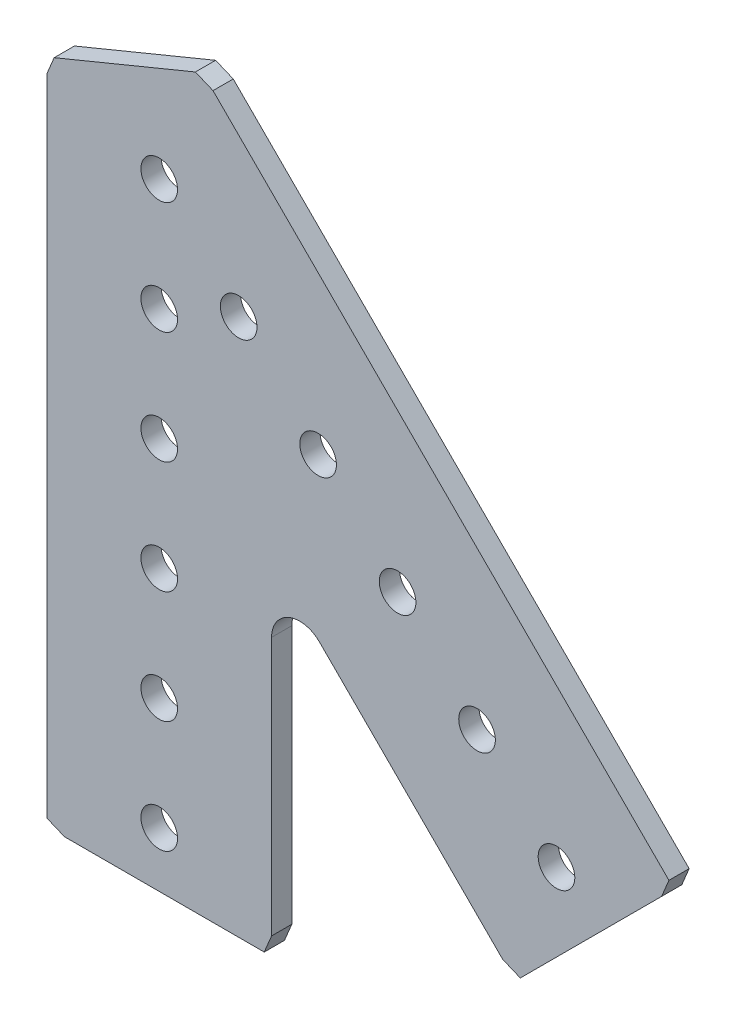
ISO-10303-21;
HEADER;
FILE_DESCRIPTION(('STEP AP214'),'2;1');
FILE_NAME('part.step','',(''),(''),'','','');
FILE_SCHEMA(('AUTOMOTIVE_DESIGN { 1 0 10303 214 1 1 1 1 }'));
ENDSEC;
DATA;
#1=APPLICATION_CONTEXT('core data for automotive mechanical design processes');
#2=APPLICATION_PROTOCOL_DEFINITION('international standard','automotive_design',2000,#1);
#3=PRODUCT_CONTEXT('',#1,'mechanical');
#4=PRODUCT('Part','Part','',(#3));
#5=PRODUCT_RELATED_PRODUCT_CATEGORY('part','',(#4));
#6=PRODUCT_DEFINITION_FORMATION('','',#4);
#7=PRODUCT_DEFINITION_CONTEXT('part definition',#1,'design');
#8=PRODUCT_DEFINITION('design','',#6,#7);
#9=PRODUCT_DEFINITION_SHAPE('','',#8);
#10=(LENGTH_UNIT() NAMED_UNIT(*) SI_UNIT(.MILLI.,.METRE.));
#11=(NAMED_UNIT(*) PLANE_ANGLE_UNIT() SI_UNIT($,.RADIAN.));
#12=(NAMED_UNIT(*) SI_UNIT($,.STERADIAN.) SOLID_ANGLE_UNIT());
#13=UNCERTAINTY_MEASURE_WITH_UNIT(LENGTH_MEASURE(1.E-05),#10,'distance_accuracy_value','');
#14=(GEOMETRIC_REPRESENTATION_CONTEXT(3) GLOBAL_UNCERTAINTY_ASSIGNED_CONTEXT((#13)) GLOBAL_UNIT_ASSIGNED_CONTEXT((#10,
#11,#12)) REPRESENTATION_CONTEXT('',''));
#15=CARTESIAN_POINT('',(0.,0.,0.));
#16=DIRECTION('',(0.,0.,1.));
#17=DIRECTION('',(1.,0.,0.));
#18=AXIS2_PLACEMENT_3D('',#15,#16,#17);
#19=CARTESIAN_POINT('',(-11.870532284943,5.94973328401229,0.));
#20=DIRECTION('',(-0.923253761571207,0.384190697108372,0.));
#21=DIRECTION('',(-0.384190697108372,-0.923253761571207,0.));
#22=AXIS2_PLACEMENT_3D('',#19,#20,#21);
#23=PLANE('',#22);
#24=DIRECTION('',(-0.384190697108372,-0.923253761571207,0.));
#25=VECTOR('',#24,1.);
#26=CARTESIAN_POINT('',(-11.870532284943,5.94973328401229,2.286));
#27=LINE('',#26,#25);
#28=CARTESIAN_POINT('',(-11.870532284943,5.94973328401229,2.286));
#29=VERTEX_POINT('',#28);
#30=CARTESIAN_POINT('',(-12.7,3.95642841278006,2.286));
#31=VERTEX_POINT('',#30);
#32=EDGE_CURVE('E166',#29,#31,#27,.T.);
#33=ORIENTED_EDGE('',*,*,#32,.F.);
#34=DIRECTION('',(0.,0.,1.));
#35=VECTOR('',#34,1.);
#36=CARTESIAN_POINT('',(-11.870532284943,5.94973328401229,0.));
#37=LINE('',#36,#35);
#38=CARTESIAN_POINT('',(-11.870532284943,5.94973328401229,0.));
#39=VERTEX_POINT('',#38);
#40=EDGE_CURVE('E11',#39,#29,#37,.T.);
#41=ORIENTED_EDGE('',*,*,#40,.F.);
#42=DIRECTION('',(-0.384190697108372,-0.923253761571207,0.));
#43=VECTOR('',#42,1.);
#44=CARTESIAN_POINT('',(-11.870532284943,5.94973328401229,0.));
#45=LINE('',#44,#43);
#46=CARTESIAN_POINT('',(-12.7,3.95642841278006,0.));
#47=VERTEX_POINT('',#46);
#48=EDGE_CURVE('E205',#39,#47,#45,.T.);
#49=ORIENTED_EDGE('',*,*,#48,.T.);
#50=DIRECTION('',(0.,0.,1.));
#51=VECTOR('',#50,1.);
#52=CARTESIAN_POINT('',(-12.7,3.95642841278006,0.));
#53=LINE('',#52,#51);
#54=EDGE_CURVE('E36',#47,#31,#53,.T.);
#55=ORIENTED_EDGE('',*,*,#54,.T.);
#56=EDGE_LOOP('',(#33,#41,#49,#55));
#57=FACE_BOUND('',#56,.T.);
#58=ADVANCED_FACE('F33',(#57),#23,.T.);
#59=CARTESIAN_POINT('',(4.08770862051389,12.5293613430272,0.));
#60=DIRECTION('',(-0.381175148368868,0.924502842757107,0.));
#61=DIRECTION('',(-0.924502842757107,-0.381175148368868,0.));
#62=AXIS2_PLACEMENT_3D('',#59,#60,#61);
#63=PLANE('',#62);
#64=DIRECTION('',(-0.924502842757106,-0.381175148368868,0.));
#65=VECTOR('',#64,1.);
#66=CARTESIAN_POINT('',(4.08770862051389,12.5293613430272,2.286));
#67=LINE('',#66,#65);
#68=CARTESIAN_POINT('',(4.08770862051389,12.5293613430272,2.286));
#69=VERTEX_POINT('',#68);
#70=EDGE_CURVE('E203',#69,#29,#67,.T.);
#71=ORIENTED_EDGE('',*,*,#70,.F.);
#72=DIRECTION('',(0.,0.,1.));
#73=VECTOR('',#72,1.);
#74=CARTESIAN_POINT('',(4.08770862051389,12.5293613430272,0.));
#75=LINE('',#74,#73);
#76=CARTESIAN_POINT('',(4.08770862051389,12.5293613430272,0.));
#77=VERTEX_POINT('',#76);
#78=EDGE_CURVE('E42',#77,#69,#75,.T.);
#79=ORIENTED_EDGE('',*,*,#78,.F.);
#80=DIRECTION('',(-0.924502842757106,-0.381175148368868,0.));
#81=VECTOR('',#80,1.);
#82=CARTESIAN_POINT('',(4.08770862051389,12.5293613430272,0.));
#83=LINE('',#82,#81);
#84=EDGE_CURVE('E156',#77,#39,#83,.T.);
#85=ORIENTED_EDGE('',*,*,#84,.T.);
#86=ORIENTED_EDGE('',*,*,#40,.T.);
#87=EDGE_LOOP('',(#71,#79,#85,#86));
#88=FACE_BOUND('',#87,.T.);
#89=ADVANCED_FACE('F229',(#88),#63,.T.);
#90=CARTESIAN_POINT('',(6.0810134917472,11.6998936279698,0.));
#91=DIRECTION('',(0.384190697108371,0.923253761571208,0.));
#92=DIRECTION('',(-0.923253761571208,0.384190697108371,0.));
#93=AXIS2_PLACEMENT_3D('',#90,#91,#92);
#94=PLANE('',#93);
#95=DIRECTION('',(-0.923253761571207,0.384190697108371,0.));
#96=VECTOR('',#95,1.);
#97=CARTESIAN_POINT('',(6.0810134917472,11.6998936279698,2.286));
#98=LINE('',#97,#96);
#99=CARTESIAN_POINT('',(6.0810134917472,11.6998936279698,2.286));
#100=VERTEX_POINT('',#99);
#101=EDGE_CURVE('E143',#100,#69,#98,.T.);
#102=ORIENTED_EDGE('',*,*,#101,.F.);
#103=DIRECTION('',(0.,0.,1.));
#104=VECTOR('',#103,1.);
#105=CARTESIAN_POINT('',(6.0810134917472,11.6998936279698,0.));
#106=LINE('',#105,#104);
#107=CARTESIAN_POINT('',(6.0810134917472,11.6998936279698,0.));
#108=VERTEX_POINT('',#107);
#109=EDGE_CURVE('E138',#108,#100,#106,.T.);
#110=ORIENTED_EDGE('',*,*,#109,.F.);
#111=DIRECTION('',(-0.923253761571207,0.384190697108371,0.));
#112=VECTOR('',#111,1.);
#113=CARTESIAN_POINT('',(6.0810134917472,11.6998936279698,0.));
#114=LINE('',#113,#112);
#115=EDGE_CURVE('E141',#108,#77,#114,.T.);
#116=ORIENTED_EDGE('',*,*,#115,.T.);
#117=ORIENTED_EDGE('',*,*,#78,.T.);
#118=EDGE_LOOP('',(#102,#110,#116,#117));
#119=FACE_BOUND('',#118,.T.);
#120=ADVANCED_FACE('F140',(#119),#94,.T.);
#121=CARTESIAN_POINT('',(57.6101410864402,-39.8292339667238,0.));
#122=DIRECTION('',(0.707106781186551,0.707106781186543,0.));
#123=DIRECTION('',(-0.707106781186544,0.707106781186552,0.));
#124=AXIS2_PLACEMENT_3D('',#121,#122,#123);
#125=PLANE('',#124);
#126=DIRECTION('',(-0.707106781186543,0.707106781186551,0.));
#127=VECTOR('',#126,1.);
#128=CARTESIAN_POINT('',(57.6101410864402,-39.8292339667238,2.286));
#129=LINE('',#128,#127);
#130=CARTESIAN_POINT('',(57.6101410864402,-39.8292339667238,2.286));
#131=VERTEX_POINT('',#130);
#132=EDGE_CURVE('E200',#131,#100,#129,.T.);
#133=ORIENTED_EDGE('',*,*,#132,.F.);
#134=DIRECTION('',(0.,0.,1.));
#135=VECTOR('',#134,1.);
#136=CARTESIAN_POINT('',(57.6101410864402,-39.8292339667238,0.));
#137=LINE('',#136,#135);
#138=CARTESIAN_POINT('',(57.6101410864402,-39.8292339667238,0.));
#139=VERTEX_POINT('',#138);
#140=EDGE_CURVE('E148',#139,#131,#137,.T.);
#141=ORIENTED_EDGE('',*,*,#140,.F.);
#142=DIRECTION('',(-0.707106781186543,0.707106781186551,0.));
#143=VECTOR('',#142,1.);
#144=CARTESIAN_POINT('',(57.6101410864402,-39.8292339667238,0.));
#145=LINE('',#144,#143);
#146=EDGE_CURVE('E154',#139,#108,#145,.T.);
#147=ORIENTED_EDGE('',*,*,#146,.T.);
#148=ORIENTED_EDGE('',*,*,#109,.T.);
#149=EDGE_LOOP('',(#133,#141,#147,#148));
#150=FACE_BOUND('',#149,.T.);
#151=ADVANCED_FACE('F158',(#150),#125,.T.);
#152=CARTESIAN_POINT('',(56.780673371383,-41.8225388379564,0.));
#153=DIRECTION('',(0.923253761571206,-0.384190697108373,0.));
#154=DIRECTION('',(0.384190697108374,0.923253761571207,0.));
#155=AXIS2_PLACEMENT_3D('',#152,#153,#154);
#156=PLANE('',#155);
#157=DIRECTION('',(0.384190697108373,0.923253761571206,0.));
#158=VECTOR('',#157,1.);
#159=CARTESIAN_POINT('',(56.780673371383,-41.8225388379564,2.286));
#160=LINE('',#159,#158);
#161=CARTESIAN_POINT('',(56.780673371383,-41.8225388379564,2.286));
#162=VERTEX_POINT('',#161);
#163=EDGE_CURVE('E197',#162,#131,#160,.T.);
#164=ORIENTED_EDGE('',*,*,#163,.F.);
#165=DIRECTION('',(0.,0.,1.));
#166=VECTOR('',#165,1.);
#167=CARTESIAN_POINT('',(56.780673371383,-41.8225388379564,0.));
#168=LINE('',#167,#166);
#169=CARTESIAN_POINT('',(56.780673371383,-41.8225388379564,0.));
#170=VERTEX_POINT('',#169);
#171=EDGE_CURVE('E209',#170,#162,#168,.T.);
#172=ORIENTED_EDGE('',*,*,#171,.F.);
#173=DIRECTION('',(0.384190697108373,0.923253761571206,0.));
#174=VECTOR('',#173,1.);
#175=CARTESIAN_POINT('',(56.780673371383,-41.8225388379564,0.));
#176=LINE('',#175,#174);
#177=EDGE_CURVE('E159',#170,#139,#176,.T.);
#178=ORIENTED_EDGE('',*,*,#177,.T.);
#179=ORIENTED_EDGE('',*,*,#140,.T.);
#180=EDGE_LOOP('',(#164,#172,#178,#179));
#181=FACE_BOUND('',#180,.T.);
#182=ADVANCED_FACE('F242',(#181),#156,.T.);
#183=CARTESIAN_POINT('',(40.8134660004771,-57.7897462088621,0.));
#184=DIRECTION('',(0.707106781186544,-0.707106781186551,0.));
#185=DIRECTION('',(0.707106781186551,0.707106781186544,0.));
#186=AXIS2_PLACEMENT_3D('',#183,#184,#185);
#187=PLANE('',#186);
#188=DIRECTION('',(0.707106781186551,0.707106781186544,0.));
#189=VECTOR('',#188,1.);
#190=CARTESIAN_POINT('',(40.8134660004771,-57.7897462088621,2.286));
#191=LINE('',#190,#189);
#192=CARTESIAN_POINT('',(40.8134660004771,-57.7897462088621,2.286));
#193=VERTEX_POINT('',#192);
#194=EDGE_CURVE('E194',#193,#162,#191,.T.);
#195=ORIENTED_EDGE('',*,*,#194,.F.);
#196=DIRECTION('',(0.,0.,1.));
#197=VECTOR('',#196,1.);
#198=CARTESIAN_POINT('',(40.8134660004771,-57.7897462088621,0.));
#199=LINE('',#198,#197);
#200=CARTESIAN_POINT('',(40.8134660004771,-57.7897462088621,0.));
#201=VERTEX_POINT('',#200);
#202=EDGE_CURVE('E211',#201,#193,#199,.T.);
#203=ORIENTED_EDGE('',*,*,#202,.F.);
#204=DIRECTION('',(0.707106781186551,0.707106781186544,0.));
#205=VECTOR('',#204,1.);
#206=CARTESIAN_POINT('',(40.8134660004771,-57.7897462088621,0.));
#207=LINE('',#206,#205);
#208=EDGE_CURVE('E161',#201,#170,#207,.T.);
#209=ORIENTED_EDGE('',*,*,#208,.T.);
#210=ORIENTED_EDGE('',*,*,#171,.T.);
#211=EDGE_LOOP('',(#195,#203,#209,#210));
#212=FACE_BOUND('',#211,.T.);
#213=ADVANCED_FACE('F245',(#212),#187,.T.);
#214=CARTESIAN_POINT('',(38.8201611292449,-56.9602784938051,0.));
#215=DIRECTION('',(-0.384190697108378,-0.923253761571205,0.));
#216=DIRECTION('',(0.923253761571205,-0.384190697108378,0.));
#217=AXIS2_PLACEMENT_3D('',#214,#215,#216);
#218=PLANE('',#217);
#219=DIRECTION('',(0.923253761571205,-0.384190697108378,0.));
#220=VECTOR('',#219,1.);
#221=CARTESIAN_POINT('',(38.8201611292449,-56.9602784938051,2.286));
#222=LINE('',#221,#220);
#223=CARTESIAN_POINT('',(38.8201611292449,-56.9602784938051,2.286));
#224=VERTEX_POINT('',#223);
#225=EDGE_CURVE('E191',#224,#193,#222,.T.);
#226=ORIENTED_EDGE('',*,*,#225,.F.);
#227=DIRECTION('',(0.,0.,1.));
#228=VECTOR('',#227,1.);
#229=CARTESIAN_POINT('',(38.8201611292449,-56.9602784938051,0.));
#230=LINE('',#229,#228);
#231=CARTESIAN_POINT('',(38.8201611292449,-56.9602784938051,0.));
#232=VERTEX_POINT('',#231);
#233=EDGE_CURVE('E213',#232,#224,#230,.T.);
#234=ORIENTED_EDGE('',*,*,#233,.F.);
#235=DIRECTION('',(0.923253761571205,-0.384190697108378,0.));
#236=VECTOR('',#235,1.);
#237=CARTESIAN_POINT('',(38.8201611292449,-56.9602784938051,0.));
#238=LINE('',#237,#236);
#239=EDGE_CURVE('E423',#232,#201,#238,.T.);
#240=ORIENTED_EDGE('',*,*,#239,.T.);
#241=ORIENTED_EDGE('',*,*,#202,.T.);
#242=EDGE_LOOP('',(#226,#234,#240,#241));
#243=FACE_BOUND('',#242,.T.);
#244=ADVANCED_FACE('F249',(#243),#218,.T.);
#245=CARTESIAN_POINT('',(18.1200640302673,-36.2601813948275,0.));
#246=DIRECTION('',(-0.707106781186548,-0.707106781186548,0.));
#247=DIRECTION('',(0.707106781186548,-0.707106781186548,0.));
#248=AXIS2_PLACEMENT_3D('',#245,#246,#247);
#249=PLANE('',#248);
#250=DIRECTION('',(0.707106781186548,-0.707106781186548,0.));
#251=VECTOR('',#250,1.);
#252=CARTESIAN_POINT('',(18.1200640302673,-36.2601813948275,2.286));
#253=LINE('',#252,#251);
#254=CARTESIAN_POINT('',(18.1200640302673,-36.2601813948275,2.286));
#255=VERTEX_POINT('',#254);
#256=EDGE_CURVE('E188',#255,#224,#253,.T.);
#257=ORIENTED_EDGE('',*,*,#256,.F.);
#258=DIRECTION('',(0.,0.,1.));
#259=VECTOR('',#258,1.);
#260=CARTESIAN_POINT('',(18.1200640302673,-36.2601813948275,0.));
#261=LINE('',#260,#259);
#262=CARTESIAN_POINT('',(18.1200640302673,-36.2601813948275,0.));
#263=VERTEX_POINT('',#262);
#264=EDGE_CURVE('E215',#263,#255,#261,.T.);
#265=ORIENTED_EDGE('',*,*,#264,.F.);
#266=DIRECTION('',(0.707106781186548,-0.707106781186548,0.));
#267=VECTOR('',#266,1.);
#268=CARTESIAN_POINT('',(18.1200640302673,-36.2601813948275,0.));
#269=LINE('',#268,#267);
#270=EDGE_CURVE('E420',#263,#232,#269,.T.);
#271=ORIENTED_EDGE('',*,*,#270,.T.);
#272=ORIENTED_EDGE('',*,*,#233,.T.);
#273=EDGE_LOOP('',(#257,#265,#271,#272));
#274=FACE_BOUND('',#273,.T.);
#275=ADVANCED_FACE('F253',(#274),#249,.T.);
#276=CARTESIAN_POINT('',(15.875,-38.5052454250948,0.));
#277=DIRECTION('',(0.,0.,1.));
#278=DIRECTION('',(1.,0.,0.));
#279=AXIS2_PLACEMENT_3D('',#276,#277,#278);
#280=CYLINDRICAL_SURFACE('',#279,3.175);
#281=CARTESIAN_POINT('',(15.875,-38.5052454250948,2.286));
#282=DIRECTION('',(0.,0.,-1.));
#283=DIRECTION('',(-1.,0.,0.));
#284=AXIS2_PLACEMENT_3D('',#281,#282,#283);
#285=CIRCLE('',#284,3.175);
#286=CARTESIAN_POINT('',(12.7,-38.5052454250948,2.286));
#287=VERTEX_POINT('',#286);
#288=EDGE_CURVE('E185',#287,#255,#285,.T.);
#289=ORIENTED_EDGE('',*,*,#288,.F.);
#290=DIRECTION('',(0.,0.,1.));
#291=VECTOR('',#290,1.);
#292=CARTESIAN_POINT('',(12.7,-38.5052454250948,0.));
#293=LINE('',#292,#291);
#294=CARTESIAN_POINT('',(12.7,-38.5052454250948,0.));
#295=VERTEX_POINT('',#294);
#296=EDGE_CURVE('E217',#295,#287,#293,.T.);
#297=ORIENTED_EDGE('',*,*,#296,.F.);
#298=CARTESIAN_POINT('',(15.875,-38.5052454250948,0.));
#299=DIRECTION('',(0.,0.,-1.));
#300=DIRECTION('',(-1.,0.,0.));
#301=AXIS2_PLACEMENT_3D('',#298,#299,#300);
#302=CIRCLE('',#301,3.175);
#303=EDGE_CURVE('E417',#295,#263,#302,.T.);
#304=ORIENTED_EDGE('',*,*,#303,.T.);
#305=ORIENTED_EDGE('',*,*,#264,.T.);
#306=EDGE_LOOP('',(#289,#297,#304,#305));
#307=FACE_BOUND('',#306,.T.);
#308=ADVANCED_FACE('F257',(#307),#280,.F.);
#309=CARTESIAN_POINT('',(12.7,-67.7296951287677,0.));
#310=DIRECTION('',(1.,0.,0.));
#311=DIRECTION('',(0.,1.,0.));
#312=AXIS2_PLACEMENT_3D('',#309,#310,#311);
#313=PLANE('',#312);
#314=DIRECTION('',(0.,1.,0.));
#315=VECTOR('',#314,1.);
#316=CARTESIAN_POINT('',(12.7,-67.7296951287677,2.286));
#317=LINE('',#316,#315);
#318=CARTESIAN_POINT('',(12.7,-67.7296951287677,2.286));
#319=VERTEX_POINT('',#318);
#320=EDGE_CURVE('E182',#319,#287,#317,.T.);
#321=ORIENTED_EDGE('',*,*,#320,.F.);
#322=DIRECTION('',(0.,0.,1.));
#323=VECTOR('',#322,1.);
#324=CARTESIAN_POINT('',(12.7,-67.7296951287677,0.));
#325=LINE('',#324,#323);
#326=CARTESIAN_POINT('',(12.7,-67.7296951287677,0.));
#327=VERTEX_POINT('',#326);
#328=EDGE_CURVE('E219',#327,#319,#325,.T.);
#329=ORIENTED_EDGE('',*,*,#328,.F.);
#330=DIRECTION('',(0.,1.,0.));
#331=VECTOR('',#330,1.);
#332=CARTESIAN_POINT('',(12.7,-67.7296951287677,0.));
#333=LINE('',#332,#331);
#334=EDGE_CURVE('E414',#327,#295,#333,.T.);
#335=ORIENTED_EDGE('',*,*,#334,.T.);
#336=ORIENTED_EDGE('',*,*,#296,.T.);
#337=EDGE_LOOP('',(#321,#329,#335,#336));
#338=FACE_BOUND('',#337,.T.);
#339=ADVANCED_FACE('F261',(#338),#313,.T.);
#340=CARTESIAN_POINT('',(11.870532284943,-69.723,0.));
#341=DIRECTION('',(0.923253761571208,-0.384190697108369,0.));
#342=DIRECTION('',(0.384190697108369,0.923253761571208,0.));
#343=AXIS2_PLACEMENT_3D('',#340,#341,#342);
#344=PLANE('',#343);
#345=DIRECTION('',(0.384190697108369,0.923253761571208,0.));
#346=VECTOR('',#345,1.);
#347=CARTESIAN_POINT('',(11.870532284943,-69.723,2.286));
#348=LINE('',#347,#346);
#349=CARTESIAN_POINT('',(11.870532284943,-69.723,2.286));
#350=VERTEX_POINT('',#349);
#351=EDGE_CURVE('E179',#350,#319,#348,.T.);
#352=ORIENTED_EDGE('',*,*,#351,.F.);
#353=DIRECTION('',(0.,0.,1.));
#354=VECTOR('',#353,1.);
#355=CARTESIAN_POINT('',(11.870532284943,-69.723,0.));
#356=LINE('',#355,#354);
#357=CARTESIAN_POINT('',(11.870532284943,-69.723,0.));
#358=VERTEX_POINT('',#357);
#359=EDGE_CURVE('E221',#358,#350,#356,.T.);
#360=ORIENTED_EDGE('',*,*,#359,.F.);
#361=DIRECTION('',(0.384190697108369,0.923253761571208,0.));
#362=VECTOR('',#361,1.);
#363=CARTESIAN_POINT('',(11.870532284943,-69.723,0.));
#364=LINE('',#363,#362);
#365=EDGE_CURVE('E411',#358,#327,#364,.T.);
#366=ORIENTED_EDGE('',*,*,#365,.T.);
#367=ORIENTED_EDGE('',*,*,#328,.T.);
#368=EDGE_LOOP('',(#352,#360,#366,#367));
#369=FACE_BOUND('',#368,.T.);
#370=ADVANCED_FACE('F265',(#369),#344,.T.);
#371=CARTESIAN_POINT('',(-10.7066951287677,-69.723,0.));
#372=DIRECTION('',(0.,-1.,0.));
#373=DIRECTION('',(1.,0.,0.));
#374=AXIS2_PLACEMENT_3D('',#371,#372,#373);
#375=PLANE('',#374);
#376=DIRECTION('',(1.,0.,0.));
#377=VECTOR('',#376,1.);
#378=CARTESIAN_POINT('',(-10.7066951287677,-69.723,2.286));
#379=LINE('',#378,#377);
#380=CARTESIAN_POINT('',(-10.7066951287677,-69.723,2.286));
#381=VERTEX_POINT('',#380);
#382=EDGE_CURVE('E176',#381,#350,#379,.T.);
#383=ORIENTED_EDGE('',*,*,#382,.F.);
#384=DIRECTION('',(0.,0.,1.));
#385=VECTOR('',#384,1.);
#386=CARTESIAN_POINT('',(-10.7066951287677,-69.723,0.));
#387=LINE('',#386,#385);
#388=CARTESIAN_POINT('',(-10.7066951287677,-69.723,0.));
#389=VERTEX_POINT('',#388);
#390=EDGE_CURVE('E223',#389,#381,#387,.T.);
#391=ORIENTED_EDGE('',*,*,#390,.F.);
#392=DIRECTION('',(1.,0.,0.));
#393=VECTOR('',#392,1.);
#394=CARTESIAN_POINT('',(-10.7066951287677,-69.723,0.));
#395=LINE('',#394,#393);
#396=EDGE_CURVE('E408',#389,#358,#395,.T.);
#397=ORIENTED_EDGE('',*,*,#396,.T.);
#398=ORIENTED_EDGE('',*,*,#359,.T.);
#399=EDGE_LOOP('',(#383,#391,#397,#398));
#400=FACE_BOUND('',#399,.T.);
#401=ADVANCED_FACE('F269',(#400),#375,.T.);
#402=CARTESIAN_POINT('',(-12.7,-68.893532284943,0.));
#403=DIRECTION('',(-0.384190697108371,-0.923253761571207,0.));
#404=DIRECTION('',(0.923253761571208,-0.384190697108371,0.));
#405=AXIS2_PLACEMENT_3D('',#402,#403,#404);
#406=PLANE('',#405);
#407=DIRECTION('',(0.923253761571208,-0.384190697108371,0.));
#408=VECTOR('',#407,1.);
#409=CARTESIAN_POINT('',(-12.7,-68.893532284943,2.286));
#410=LINE('',#409,#408);
#411=CARTESIAN_POINT('',(-12.7,-68.893532284943,2.286));
#412=VERTEX_POINT('',#411);
#413=EDGE_CURVE('E173',#412,#381,#410,.T.);
#414=ORIENTED_EDGE('',*,*,#413,.F.);
#415=DIRECTION('',(0.,0.,1.));
#416=VECTOR('',#415,1.);
#417=CARTESIAN_POINT('',(-12.7,-68.893532284943,0.));
#418=LINE('',#417,#416);
#419=CARTESIAN_POINT('',(-12.7,-68.893532284943,0.));
#420=VERTEX_POINT('',#419);
#421=EDGE_CURVE('E224',#420,#412,#418,.T.);
#422=ORIENTED_EDGE('',*,*,#421,.F.);
#423=DIRECTION('',(0.923253761571208,-0.384190697108371,0.));
#424=VECTOR('',#423,1.);
#425=CARTESIAN_POINT('',(-12.7,-68.893532284943,0.));
#426=LINE('',#425,#424);
#427=EDGE_CURVE('E405',#420,#389,#426,.T.);
#428=ORIENTED_EDGE('',*,*,#427,.T.);
#429=ORIENTED_EDGE('',*,*,#390,.T.);
#430=EDGE_LOOP('',(#414,#422,#428,#429));
#431=FACE_BOUND('',#430,.T.);
#432=ADVANCED_FACE('F273',(#431),#406,.T.);
#433=CARTESIAN_POINT('',(-12.7,3.95642841278006,0.));
#434=DIRECTION('',(-1.,0.,0.));
#435=DIRECTION('',(0.,-1.,0.));
#436=AXIS2_PLACEMENT_3D('',#433,#434,#435);
#437=PLANE('',#436);
#438=DIRECTION('',(0.,-1.,0.));
#439=VECTOR('',#438,1.);
#440=CARTESIAN_POINT('',(-12.7,3.95642841278006,2.286));
#441=LINE('',#440,#439);
#442=EDGE_CURVE('E169',#31,#412,#441,.T.);
#443=ORIENTED_EDGE('',*,*,#442,.F.);
#444=ORIENTED_EDGE('',*,*,#54,.F.);
#445=DIRECTION('',(0.,-1.,0.));
#446=VECTOR('',#445,1.);
#447=CARTESIAN_POINT('',(-12.7,3.95642841278006,0.));
#448=LINE('',#447,#446);
#449=EDGE_CURVE('E403',#47,#420,#448,.T.);
#450=ORIENTED_EDGE('',*,*,#449,.T.);
#451=ORIENTED_EDGE('',*,*,#421,.T.);
#452=EDGE_LOOP('',(#443,#444,#450,#451));
#453=FACE_BOUND('',#452,.T.);
#454=ADVANCED_FACE('F226',(#453),#437,.T.);
#455=CARTESIAN_POINT('',(15.875,-38.5052454250948,0.));
#456=DIRECTION('',(0.,0.,-1.));
#457=DIRECTION('',(-1.,0.,0.));
#458=AXIS2_PLACEMENT_3D('',#455,#456,#457);
#459=PLANE('',#458);
#460=CARTESIAN_POINT('',(44.9012806053455,-44.901280605346,0.));
#461=DIRECTION('',(0.,0.,1.));
#462=DIRECTION('',(-1.,0.,0.));
#463=AXIS2_PLACEMENT_3D('',#460,#461,#462);
#464=CIRCLE('',#463,2.0701);
#465=CARTESIAN_POINT('',(42.8311806053455,-44.901280605346,0.));
#466=VERTEX_POINT('',#465);
#467=EDGE_CURVE('E336',#466,#466,#464,.T.);
#468=ORIENTED_EDGE('',*,*,#467,.T.);
#469=EDGE_LOOP('',(#468));
#470=FACE_BOUND('',#469,.T.);
#471=CARTESIAN_POINT('',(26.9407683632073,-26.9407683632076,0.));
#472=DIRECTION('',(0.,0.,1.));
#473=DIRECTION('',(-1.,0.,0.));
#474=AXIS2_PLACEMENT_3D('',#471,#472,#473);
#475=CIRCLE('',#474,2.0701);
#476=CARTESIAN_POINT('',(24.8706683632073,-26.9407683632076,0.));
#477=VERTEX_POINT('',#476);
#478=EDGE_CURVE('E344',#477,#477,#475,.T.);
#479=ORIENTED_EDGE('',*,*,#478,.T.);
#480=EDGE_LOOP('',(#479));
#481=FACE_BOUND('',#480,.T.);
#482=CARTESIAN_POINT('',(0.,-50.8,0.));
#483=DIRECTION('',(0.,0.,1.));
#484=DIRECTION('',(-1.,0.,0.));
#485=AXIS2_PLACEMENT_3D('',#482,#483,#484);
#486=CIRCLE('',#485,2.0701);
#487=CARTESIAN_POINT('',(-2.07009999999999,-50.8,0.));
#488=VERTEX_POINT('',#487);
#489=EDGE_CURVE('E350',#488,#488,#486,.T.);
#490=ORIENTED_EDGE('',*,*,#489,.T.);
#491=EDGE_LOOP('',(#490));
#492=FACE_BOUND('',#491,.T.);
#493=CARTESIAN_POINT('',(2.66050878019847E-13,-25.4,0.));
#494=DIRECTION('',(0.,0.,1.));
#495=DIRECTION('',(-1.,0.,0.));
#496=AXIS2_PLACEMENT_3D('',#493,#494,#495);
#497=CIRCLE('',#496,2.0701);
#498=CARTESIAN_POINT('',(-2.07009999999973,-25.4,0.));
#499=VERTEX_POINT('',#498);
#500=EDGE_CURVE('E356',#499,#499,#497,.T.);
#501=ORIENTED_EDGE('',*,*,#500,.T.);
#502=EDGE_LOOP('',(#501));
#503=FACE_BOUND('',#502,.T.);
#504=CARTESIAN_POINT('',(8.98025612106911,-8.9802561210692,0.));
#505=DIRECTION('',(0.,0.,1.));
#506=DIRECTION('',(-1.,0.,0.));
#507=AXIS2_PLACEMENT_3D('',#504,#505,#506);
#508=CIRCLE('',#507,2.0701);
#509=CARTESIAN_POINT('',(6.9101561210691,-8.9802561210692,0.));
#510=VERTEX_POINT('',#509);
#511=EDGE_CURVE('E362',#510,#510,#508,.T.);
#512=ORIENTED_EDGE('',*,*,#511,.T.);
#513=EDGE_LOOP('',(#512));
#514=FACE_BOUND('',#513,.T.);
#515=CARTESIAN_POINT('',(0.,0.,0.));
#516=DIRECTION('',(0.,0.,1.));
#517=DIRECTION('',(-1.,0.,0.));
#518=AXIS2_PLACEMENT_3D('',#515,#516,#517);
#519=CIRCLE('',#518,2.0701);
#520=CARTESIAN_POINT('',(-2.0701,0.,0.));
#521=VERTEX_POINT('',#520);
#522=EDGE_CURVE('E368',#521,#521,#519,.T.);
#523=ORIENTED_EDGE('',*,*,#522,.T.);
#524=EDGE_LOOP('',(#523));
#525=FACE_BOUND('',#524,.T.);
#526=CARTESIAN_POINT('',(1.33025439009923E-13,-12.7,0.));
#527=DIRECTION('',(0.,0.,1.));
#528=DIRECTION('',(-1.,0.,0.));
#529=AXIS2_PLACEMENT_3D('',#526,#527,#528);
#530=CIRCLE('',#529,2.0701);
#531=CARTESIAN_POINT('',(-2.07009999999987,-12.7,0.));
#532=VERTEX_POINT('',#531);
#533=EDGE_CURVE('E374',#532,#532,#530,.T.);
#534=ORIENTED_EDGE('',*,*,#533,.T.);
#535=EDGE_LOOP('',(#534));
#536=FACE_BOUND('',#535,.T.);
#537=CARTESIAN_POINT('',(3.9907631702977E-13,-38.1,0.));
#538=DIRECTION('',(0.,0.,1.));
#539=DIRECTION('',(-1.,0.,0.));
#540=AXIS2_PLACEMENT_3D('',#537,#538,#539);
#541=CIRCLE('',#540,2.0701);
#542=CARTESIAN_POINT('',(-2.0700999999996,-38.1,0.));
#543=VERTEX_POINT('',#542);
#544=EDGE_CURVE('E380',#543,#543,#541,.T.);
#545=ORIENTED_EDGE('',*,*,#544,.T.);
#546=EDGE_LOOP('',(#545));
#547=FACE_BOUND('',#546,.T.);
#548=CARTESIAN_POINT('',(17.9605122421382,-17.9605122421384,0.));
#549=DIRECTION('',(0.,0.,1.));
#550=DIRECTION('',(-1.,0.,0.));
#551=AXIS2_PLACEMENT_3D('',#548,#549,#550);
#552=CIRCLE('',#551,2.0701);
#553=CARTESIAN_POINT('',(15.8904122421382,-17.9605122421384,0.));
#554=VERTEX_POINT('',#553);
#555=EDGE_CURVE('E386',#554,#554,#552,.T.);
#556=ORIENTED_EDGE('',*,*,#555,.T.);
#557=EDGE_LOOP('',(#556));
#558=FACE_BOUND('',#557,.T.);
#559=CARTESIAN_POINT('',(35.9210244842764,-35.9210244842768,0.));
#560=DIRECTION('',(0.,0.,1.));
#561=DIRECTION('',(-1.,0.,0.));
#562=AXIS2_PLACEMENT_3D('',#559,#560,#561);
#563=CIRCLE('',#562,2.0701);
#564=CARTESIAN_POINT('',(33.8509244842764,-35.9210244842768,0.));
#565=VERTEX_POINT('',#564);
#566=EDGE_CURVE('E392',#565,#565,#563,.T.);
#567=ORIENTED_EDGE('',*,*,#566,.T.);
#568=EDGE_LOOP('',(#567));
#569=FACE_BOUND('',#568,.T.);
#570=CARTESIAN_POINT('',(0.,-63.5,0.));
#571=DIRECTION('',(0.,0.,1.));
#572=DIRECTION('',(-1.,0.,0.));
#573=AXIS2_PLACEMENT_3D('',#570,#571,#572);
#574=CIRCLE('',#573,2.0701);
#575=CARTESIAN_POINT('',(-2.07009999999999,-63.5,0.));
#576=VERTEX_POINT('',#575);
#577=EDGE_CURVE('E170',#576,#576,#574,.T.);
#578=ORIENTED_EDGE('',*,*,#577,.T.);
#579=EDGE_LOOP('',(#578));
#580=FACE_BOUND('',#579,.T.);
#581=ORIENTED_EDGE('',*,*,#48,.F.);
#582=ORIENTED_EDGE('',*,*,#84,.F.);
#583=ORIENTED_EDGE('',*,*,#115,.F.);
#584=ORIENTED_EDGE('',*,*,#146,.F.);
#585=ORIENTED_EDGE('',*,*,#177,.F.);
#586=ORIENTED_EDGE('',*,*,#208,.F.);
#587=ORIENTED_EDGE('',*,*,#239,.F.);
#588=ORIENTED_EDGE('',*,*,#270,.F.);
#589=ORIENTED_EDGE('',*,*,#303,.F.);
#590=ORIENTED_EDGE('',*,*,#334,.F.);
#591=ORIENTED_EDGE('',*,*,#365,.F.);
#592=ORIENTED_EDGE('',*,*,#396,.F.);
#593=ORIENTED_EDGE('',*,*,#427,.F.);
#594=ORIENTED_EDGE('',*,*,#449,.F.);
#595=EDGE_LOOP('',(#581,#582,#583,#584,#585,#586,#587,#588,#589,#590,#591,#592,#593,#594));
#596=FACE_BOUND('',#595,.T.);
#597=ADVANCED_FACE('F152',(#470,#481,#492,#503,#514,#525,#536,#547,#558,#569,#580,#596),#459,.T.);
#598=CARTESIAN_POINT('',(15.875,-38.5052454250948,2.286));
#599=DIRECTION('',(0.,0.,-1.));
#600=DIRECTION('',(-1.,0.,0.));
#601=AXIS2_PLACEMENT_3D('',#598,#599,#600);
#602=PLANE('',#601);
#603=CARTESIAN_POINT('',(44.9012806053455,-44.901280605346,2.286));
#604=DIRECTION('',(0.,0.,1.));
#605=DIRECTION('',(-1.,0.,0.));
#606=AXIS2_PLACEMENT_3D('',#603,#604,#605);
#607=CIRCLE('',#606,2.0701);
#608=CARTESIAN_POINT('',(42.8311806053455,-44.901280605346,2.286));
#609=VERTEX_POINT('',#608);
#610=EDGE_CURVE('E339',#609,#609,#607,.T.);
#611=ORIENTED_EDGE('',*,*,#610,.F.);
#612=EDGE_LOOP('',(#611));
#613=FACE_BOUND('',#612,.T.);
#614=CARTESIAN_POINT('',(26.9407683632073,-26.9407683632076,2.286));
#615=DIRECTION('',(0.,0.,1.));
#616=DIRECTION('',(-1.,0.,0.));
#617=AXIS2_PLACEMENT_3D('',#614,#615,#616);
#618=CIRCLE('',#617,2.0701);
#619=CARTESIAN_POINT('',(24.8706683632073,-26.9407683632076,2.286));
#620=VERTEX_POINT('',#619);
#621=EDGE_CURVE('E341',#620,#620,#618,.T.);
#622=ORIENTED_EDGE('',*,*,#621,.F.);
#623=EDGE_LOOP('',(#622));
#624=FACE_BOUND('',#623,.T.);
#625=CARTESIAN_POINT('',(0.,-50.8,2.286));
#626=DIRECTION('',(0.,0.,1.));
#627=DIRECTION('',(-1.,0.,0.));
#628=AXIS2_PLACEMENT_3D('',#625,#626,#627);
#629=CIRCLE('',#628,2.0701);
#630=CARTESIAN_POINT('',(-2.07009999999999,-50.8,2.286));
#631=VERTEX_POINT('',#630);
#632=EDGE_CURVE('E347',#631,#631,#629,.T.);
#633=ORIENTED_EDGE('',*,*,#632,.F.);
#634=EDGE_LOOP('',(#633));
#635=FACE_BOUND('',#634,.T.);
#636=CARTESIAN_POINT('',(2.66050878019847E-13,-25.4,2.286));
#637=DIRECTION('',(0.,0.,1.));
#638=DIRECTION('',(-1.,0.,0.));
#639=AXIS2_PLACEMENT_3D('',#636,#637,#638);
#640=CIRCLE('',#639,2.0701);
#641=CARTESIAN_POINT('',(-2.07009999999973,-25.4,2.286));
#642=VERTEX_POINT('',#641);
#643=EDGE_CURVE('E353',#642,#642,#640,.T.);
#644=ORIENTED_EDGE('',*,*,#643,.F.);
#645=EDGE_LOOP('',(#644));
#646=FACE_BOUND('',#645,.T.);
#647=CARTESIAN_POINT('',(8.98025612106911,-8.9802561210692,2.286));
#648=DIRECTION('',(0.,0.,1.));
#649=DIRECTION('',(-1.,0.,0.));
#650=AXIS2_PLACEMENT_3D('',#647,#648,#649);
#651=CIRCLE('',#650,2.0701);
#652=CARTESIAN_POINT('',(6.9101561210691,-8.9802561210692,2.286));
#653=VERTEX_POINT('',#652);
#654=EDGE_CURVE('E359',#653,#653,#651,.T.);
#655=ORIENTED_EDGE('',*,*,#654,.F.);
#656=EDGE_LOOP('',(#655));
#657=FACE_BOUND('',#656,.T.);
#658=CARTESIAN_POINT('',(0.,0.,2.286));
#659=DIRECTION('',(0.,0.,1.));
#660=DIRECTION('',(-1.,0.,0.));
#661=AXIS2_PLACEMENT_3D('',#658,#659,#660);
#662=CIRCLE('',#661,2.0701);
#663=CARTESIAN_POINT('',(-2.0701,0.,2.286));
#664=VERTEX_POINT('',#663);
#665=EDGE_CURVE('E365',#664,#664,#662,.T.);
#666=ORIENTED_EDGE('',*,*,#665,.F.);
#667=EDGE_LOOP('',(#666));
#668=FACE_BOUND('',#667,.T.);
#669=CARTESIAN_POINT('',(1.33025439009923E-13,-12.7,2.286));
#670=DIRECTION('',(0.,0.,1.));
#671=DIRECTION('',(-1.,0.,0.));
#672=AXIS2_PLACEMENT_3D('',#669,#670,#671);
#673=CIRCLE('',#672,2.0701);
#674=CARTESIAN_POINT('',(-2.07009999999987,-12.7,2.286));
#675=VERTEX_POINT('',#674);
#676=EDGE_CURVE('E371',#675,#675,#673,.T.);
#677=ORIENTED_EDGE('',*,*,#676,.F.);
#678=EDGE_LOOP('',(#677));
#679=FACE_BOUND('',#678,.T.);
#680=CARTESIAN_POINT('',(3.9907631702977E-13,-38.1,2.286));
#681=DIRECTION('',(0.,0.,1.));
#682=DIRECTION('',(-1.,0.,0.));
#683=AXIS2_PLACEMENT_3D('',#680,#681,#682);
#684=CIRCLE('',#683,2.0701);
#685=CARTESIAN_POINT('',(-2.0700999999996,-38.1,2.286));
#686=VERTEX_POINT('',#685);
#687=EDGE_CURVE('E377',#686,#686,#684,.T.);
#688=ORIENTED_EDGE('',*,*,#687,.F.);
#689=EDGE_LOOP('',(#688));
#690=FACE_BOUND('',#689,.T.);
#691=CARTESIAN_POINT('',(17.9605122421382,-17.9605122421384,2.286));
#692=DIRECTION('',(0.,0.,1.));
#693=DIRECTION('',(-1.,0.,0.));
#694=AXIS2_PLACEMENT_3D('',#691,#692,#693);
#695=CIRCLE('',#694,2.0701);
#696=CARTESIAN_POINT('',(15.8904122421382,-17.9605122421384,2.286));
#697=VERTEX_POINT('',#696);
#698=EDGE_CURVE('E383',#697,#697,#695,.T.);
#699=ORIENTED_EDGE('',*,*,#698,.F.);
#700=EDGE_LOOP('',(#699));
#701=FACE_BOUND('',#700,.T.);
#702=CARTESIAN_POINT('',(35.9210244842764,-35.9210244842768,2.286));
#703=DIRECTION('',(0.,0.,1.));
#704=DIRECTION('',(-1.,0.,0.));
#705=AXIS2_PLACEMENT_3D('',#702,#703,#704);
#706=CIRCLE('',#705,2.0701);
#707=CARTESIAN_POINT('',(33.8509244842764,-35.9210244842768,2.286));
#708=VERTEX_POINT('',#707);
#709=EDGE_CURVE('E389',#708,#708,#706,.T.);
#710=ORIENTED_EDGE('',*,*,#709,.F.);
#711=EDGE_LOOP('',(#710));
#712=FACE_BOUND('',#711,.T.);
#713=CARTESIAN_POINT('',(0.,-63.5,2.286));
#714=DIRECTION('',(0.,0.,1.));
#715=DIRECTION('',(-1.,0.,0.));
#716=AXIS2_PLACEMENT_3D('',#713,#714,#715);
#717=CIRCLE('',#716,2.0701);
#718=CARTESIAN_POINT('',(-2.07009999999999,-63.5,2.286));
#719=VERTEX_POINT('',#718);
#720=EDGE_CURVE('E395',#719,#719,#717,.T.);
#721=ORIENTED_EDGE('',*,*,#720,.F.);
#722=EDGE_LOOP('',(#721));
#723=FACE_BOUND('',#722,.T.);
#724=ORIENTED_EDGE('',*,*,#32,.T.);
#725=ORIENTED_EDGE('',*,*,#442,.T.);
#726=ORIENTED_EDGE('',*,*,#413,.T.);
#727=ORIENTED_EDGE('',*,*,#382,.T.);
#728=ORIENTED_EDGE('',*,*,#351,.T.);
#729=ORIENTED_EDGE('',*,*,#320,.T.);
#730=ORIENTED_EDGE('',*,*,#288,.T.);
#731=ORIENTED_EDGE('',*,*,#256,.T.);
#732=ORIENTED_EDGE('',*,*,#225,.T.);
#733=ORIENTED_EDGE('',*,*,#194,.T.);
#734=ORIENTED_EDGE('',*,*,#163,.T.);
#735=ORIENTED_EDGE('',*,*,#132,.T.);
#736=ORIENTED_EDGE('',*,*,#101,.T.);
#737=ORIENTED_EDGE('',*,*,#70,.T.);
#738=EDGE_LOOP('',(#724,#725,#726,#727,#728,#729,#730,#731,#732,#733,#734,#735,#736,#737));
#739=FACE_BOUND('',#738,.T.);
#740=ADVANCED_FACE('F228',(#613,#624,#635,#646,#657,#668,#679,#690,#701,#712,#723,#739),#602,.F.);
#741=CARTESIAN_POINT('',(0.,-63.5,0.));
#742=DIRECTION('',(0.,0.,1.));
#743=DIRECTION('',(1.,0.,0.));
#744=AXIS2_PLACEMENT_3D('',#741,#742,#743);
#745=CYLINDRICAL_SURFACE('',#744,2.0701);
#746=ORIENTED_EDGE('',*,*,#577,.F.);
#747=EDGE_LOOP('',(#746));
#748=FACE_BOUND('',#747,.T.);
#749=ORIENTED_EDGE('',*,*,#720,.T.);
#750=EDGE_LOOP('',(#749));
#751=FACE_BOUND('',#750,.T.);
#752=ADVANCED_FACE('F285',(#748,#751),#745,.F.);
#753=CARTESIAN_POINT('',(35.9210244842764,-35.9210244842768,0.));
#754=DIRECTION('',(0.,0.,1.));
#755=DIRECTION('',(1.,0.,0.));
#756=AXIS2_PLACEMENT_3D('',#753,#754,#755);
#757=CYLINDRICAL_SURFACE('',#756,2.0701);
#758=ORIENTED_EDGE('',*,*,#566,.F.);
#759=EDGE_LOOP('',(#758));
#760=FACE_BOUND('',#759,.T.);
#761=ORIENTED_EDGE('',*,*,#709,.T.);
#762=EDGE_LOOP('',(#761));
#763=FACE_BOUND('',#762,.T.);
#764=ADVANCED_FACE('F292',(#760,#763),#757,.F.);
#765=CARTESIAN_POINT('',(17.9605122421382,-17.9605122421384,0.));
#766=DIRECTION('',(0.,0.,1.));
#767=DIRECTION('',(1.,0.,0.));
#768=AXIS2_PLACEMENT_3D('',#765,#766,#767);
#769=CYLINDRICAL_SURFACE('',#768,2.0701);
#770=ORIENTED_EDGE('',*,*,#555,.F.);
#771=EDGE_LOOP('',(#770));
#772=FACE_BOUND('',#771,.T.);
#773=ORIENTED_EDGE('',*,*,#698,.T.);
#774=EDGE_LOOP('',(#773));
#775=FACE_BOUND('',#774,.T.);
#776=ADVANCED_FACE('F296',(#772,#775),#769,.F.);
#777=CARTESIAN_POINT('',(3.9907631702977E-13,-38.1,0.));
#778=DIRECTION('',(0.,0.,1.));
#779=DIRECTION('',(1.,0.,0.));
#780=AXIS2_PLACEMENT_3D('',#777,#778,#779);
#781=CYLINDRICAL_SURFACE('',#780,2.0701);
#782=ORIENTED_EDGE('',*,*,#544,.F.);
#783=EDGE_LOOP('',(#782));
#784=FACE_BOUND('',#783,.T.);
#785=ORIENTED_EDGE('',*,*,#687,.T.);
#786=EDGE_LOOP('',(#785));
#787=FACE_BOUND('',#786,.T.);
#788=ADVANCED_FACE('F300',(#784,#787),#781,.F.);
#789=CARTESIAN_POINT('',(1.33025439009923E-13,-12.7,0.));
#790=DIRECTION('',(0.,0.,1.));
#791=DIRECTION('',(1.,0.,0.));
#792=AXIS2_PLACEMENT_3D('',#789,#790,#791);
#793=CYLINDRICAL_SURFACE('',#792,2.0701);
#794=ORIENTED_EDGE('',*,*,#533,.F.);
#795=EDGE_LOOP('',(#794));
#796=FACE_BOUND('',#795,.T.);
#797=ORIENTED_EDGE('',*,*,#676,.T.);
#798=EDGE_LOOP('',(#797));
#799=FACE_BOUND('',#798,.T.);
#800=ADVANCED_FACE('F304',(#796,#799),#793,.F.);
#801=CARTESIAN_POINT('',(0.,0.,0.));
#802=DIRECTION('',(0.,0.,1.));
#803=DIRECTION('',(1.,0.,0.));
#804=AXIS2_PLACEMENT_3D('',#801,#802,#803);
#805=CYLINDRICAL_SURFACE('',#804,2.0701);
#806=ORIENTED_EDGE('',*,*,#522,.F.);
#807=EDGE_LOOP('',(#806));
#808=FACE_BOUND('',#807,.T.);
#809=ORIENTED_EDGE('',*,*,#665,.T.);
#810=EDGE_LOOP('',(#809));
#811=FACE_BOUND('',#810,.T.);
#812=ADVANCED_FACE('F308',(#808,#811),#805,.F.);
#813=CARTESIAN_POINT('',(8.98025612106911,-8.9802561210692,0.));
#814=DIRECTION('',(0.,0.,1.));
#815=DIRECTION('',(1.,0.,0.));
#816=AXIS2_PLACEMENT_3D('',#813,#814,#815);
#817=CYLINDRICAL_SURFACE('',#816,2.0701);
#818=ORIENTED_EDGE('',*,*,#511,.F.);
#819=EDGE_LOOP('',(#818));
#820=FACE_BOUND('',#819,.T.);
#821=ORIENTED_EDGE('',*,*,#654,.T.);
#822=EDGE_LOOP('',(#821));
#823=FACE_BOUND('',#822,.T.);
#824=ADVANCED_FACE('F312',(#820,#823),#817,.F.);
#825=CARTESIAN_POINT('',(2.66050878019847E-13,-25.4,0.));
#826=DIRECTION('',(0.,0.,1.));
#827=DIRECTION('',(1.,0.,0.));
#828=AXIS2_PLACEMENT_3D('',#825,#826,#827);
#829=CYLINDRICAL_SURFACE('',#828,2.0701);
#830=ORIENTED_EDGE('',*,*,#500,.F.);
#831=EDGE_LOOP('',(#830));
#832=FACE_BOUND('',#831,.T.);
#833=ORIENTED_EDGE('',*,*,#643,.T.);
#834=EDGE_LOOP('',(#833));
#835=FACE_BOUND('',#834,.T.);
#836=ADVANCED_FACE('F316',(#832,#835),#829,.F.);
#837=CARTESIAN_POINT('',(0.,-50.8,0.));
#838=DIRECTION('',(0.,0.,1.));
#839=DIRECTION('',(1.,0.,0.));
#840=AXIS2_PLACEMENT_3D('',#837,#838,#839);
#841=CYLINDRICAL_SURFACE('',#840,2.0701);
#842=ORIENTED_EDGE('',*,*,#489,.F.);
#843=EDGE_LOOP('',(#842));
#844=FACE_BOUND('',#843,.T.);
#845=ORIENTED_EDGE('',*,*,#632,.T.);
#846=EDGE_LOOP('',(#845));
#847=FACE_BOUND('',#846,.T.);
#848=ADVANCED_FACE('F320',(#844,#847),#841,.F.);
#849=CARTESIAN_POINT('',(26.9407683632073,-26.9407683632076,0.));
#850=DIRECTION('',(0.,0.,1.));
#851=DIRECTION('',(1.,0.,0.));
#852=AXIS2_PLACEMENT_3D('',#849,#850,#851);
#853=CYLINDRICAL_SURFACE('',#852,2.0701);
#854=ORIENTED_EDGE('',*,*,#478,.F.);
#855=EDGE_LOOP('',(#854));
#856=FACE_BOUND('',#855,.T.);
#857=ORIENTED_EDGE('',*,*,#621,.T.);
#858=EDGE_LOOP('',(#857));
#859=FACE_BOUND('',#858,.T.);
#860=ADVANCED_FACE('F324',(#856,#859),#853,.F.);
#861=CARTESIAN_POINT('',(44.9012806053455,-44.901280605346,0.));
#862=DIRECTION('',(0.,0.,1.));
#863=DIRECTION('',(1.,0.,0.));
#864=AXIS2_PLACEMENT_3D('',#861,#862,#863);
#865=CYLINDRICAL_SURFACE('',#864,2.0701);
#866=ORIENTED_EDGE('',*,*,#467,.F.);
#867=EDGE_LOOP('',(#866));
#868=FACE_BOUND('',#867,.T.);
#869=ORIENTED_EDGE('',*,*,#610,.T.);
#870=EDGE_LOOP('',(#869));
#871=FACE_BOUND('',#870,.T.);
#872=ADVANCED_FACE('F328',(#868,#871),#865,.F.);
#873=CLOSED_SHELL('',(#58,#89,#120,#151,#182,#213,#244,#275,#308,#339,#370,#401,#432,#454,#597,
#740,#752,#764,#776,#788,#800,#812,#824,#836,#848,#860,#872));
#874=MANIFOLD_SOLID_BREP('B2',#873);
#875=ADVANCED_BREP_SHAPE_REPRESENTATION('',(#18,#874),#14);
#876=SHAPE_DEFINITION_REPRESENTATION(#9,#875);
ENDSEC;
END-ISO-10303-21;
